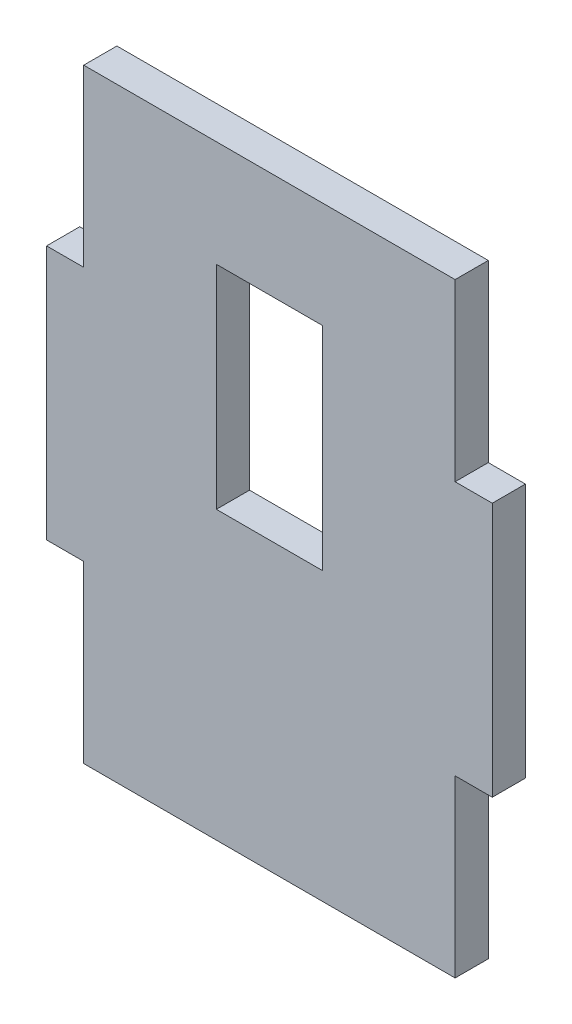
ISO-10303-21;
HEADER;
FILE_DESCRIPTION(('STEP AP214'),'2;1');
FILE_NAME('part.step','',(''),(''),'','','');
FILE_SCHEMA(('AUTOMOTIVE_DESIGN { 1 0 10303 214 1 1 1 1 }'));
ENDSEC;
DATA;
#1=APPLICATION_CONTEXT('core data for automotive mechanical design processes');
#2=APPLICATION_PROTOCOL_DEFINITION('international standard','automotive_design',2000,#1);
#3=PRODUCT_CONTEXT('',#1,'mechanical');
#4=PRODUCT('Part','Part','',(#3));
#5=PRODUCT_RELATED_PRODUCT_CATEGORY('part','',(#4));
#6=PRODUCT_DEFINITION_FORMATION('','',#4);
#7=PRODUCT_DEFINITION_CONTEXT('part definition',#1,'design');
#8=PRODUCT_DEFINITION('design','',#6,#7);
#9=PRODUCT_DEFINITION_SHAPE('','',#8);
#10=(LENGTH_UNIT() NAMED_UNIT(*) SI_UNIT(.MILLI.,.METRE.));
#11=(NAMED_UNIT(*) PLANE_ANGLE_UNIT() SI_UNIT($,.RADIAN.));
#12=(NAMED_UNIT(*) SI_UNIT($,.STERADIAN.) SOLID_ANGLE_UNIT());
#13=UNCERTAINTY_MEASURE_WITH_UNIT(LENGTH_MEASURE(1.E-05),#10,'distance_accuracy_value','');
#14=(GEOMETRIC_REPRESENTATION_CONTEXT(3) GLOBAL_UNCERTAINTY_ASSIGNED_CONTEXT((#13)) GLOBAL_UNIT_ASSIGNED_CONTEXT((#10,
#11,#12)) REPRESENTATION_CONTEXT('',''));
#15=CARTESIAN_POINT('',(0.,0.,0.));
#16=DIRECTION('',(0.,0.,1.));
#17=DIRECTION('',(1.,0.,0.));
#18=AXIS2_PLACEMENT_3D('',#15,#16,#17);
#19=CARTESIAN_POINT('',(-109.779310344828,244.11724137931,25.));
#20=DIRECTION('',(1.,0.,0.));
#21=DIRECTION('',(0.,0.,-1.));
#22=AXIS2_PLACEMENT_3D('',#19,#20,#21);
#23=PLANE('',#22);
#24=DIRECTION('',(0.,0.,-1.));
#25=VECTOR('',#24,1.);
#26=CARTESIAN_POINT('',(-109.779310344828,-79.8827586206897,25.));
#27=LINE('',#26,#25);
#28=CARTESIAN_POINT('',(-109.779310344828,-79.8827586206897,25.));
#29=VERTEX_POINT('',#28);
#30=CARTESIAN_POINT('',(-109.779310344828,-79.8827586206896,0.));
#31=VERTEX_POINT('',#30);
#32=EDGE_CURVE('E259',#29,#31,#27,.T.);
#33=ORIENTED_EDGE('',*,*,#32,.F.);
#34=DIRECTION('',(0.,-1.,0.));
#35=VECTOR('',#34,1.);
#36=CARTESIAN_POINT('',(-109.779310344828,244.11724137931,25.));
#37=LINE('',#36,#35);
#38=CARTESIAN_POINT('',(-109.779310344828,112.11724137931,25.));
#39=VERTEX_POINT('',#38);
#40=EDGE_CURVE('E298',#39,#29,#37,.T.);
#41=ORIENTED_EDGE('',*,*,#40,.F.);
#42=DIRECTION('',(0.,0.,-1.));
#43=VECTOR('',#42,1.);
#44=CARTESIAN_POINT('',(-109.779310344828,112.11724137931,25.));
#45=LINE('',#44,#43);
#46=CARTESIAN_POINT('',(-109.779310344828,112.11724137931,0.));
#47=VERTEX_POINT('',#46);
#48=EDGE_CURVE('E293',#39,#47,#45,.T.);
#49=ORIENTED_EDGE('',*,*,#48,.T.);
#50=DIRECTION('',(0.,-1.,0.));
#51=VECTOR('',#50,1.);
#52=CARTESIAN_POINT('',(-109.779310344828,244.11724137931,0.));
#53=LINE('',#52,#51);
#54=EDGE_CURVE('E297',#47,#31,#53,.T.);
#55=ORIENTED_EDGE('',*,*,#54,.T.);
#56=EDGE_LOOP('',(#33,#41,#49,#55));
#57=FACE_BOUND('',#56,.T.);
#58=ADVANCED_FACE('F38',(#57),#23,.F.);
#59=CARTESIAN_POINT('',(-109.779310344828,-211.88275862069,25.));
#60=DIRECTION('',(0.,1.,0.));
#61=DIRECTION('',(0.,0.,1.));
#62=AXIS2_PLACEMENT_3D('',#59,#60,#61);
#63=PLANE('',#62);
#64=DIRECTION('',(0.,0.,-1.));
#65=VECTOR('',#64,1.);
#66=CARTESIAN_POINT('',(-81.7793103448277,-211.88275862069,25.));
#67=LINE('',#66,#65);
#68=CARTESIAN_POINT('',(-81.7793103448277,-211.88275862069,25.));
#69=VERTEX_POINT('',#68);
#70=CARTESIAN_POINT('',(-81.7793103448277,-211.88275862069,0.));
#71=VERTEX_POINT('',#70);
#72=EDGE_CURVE('E240',#69,#71,#67,.T.);
#73=ORIENTED_EDGE('',*,*,#72,.T.);
#74=DIRECTION('',(1.,0.,0.));
#75=VECTOR('',#74,1.);
#76=CARTESIAN_POINT('',(-109.779310344828,-211.88275862069,0.));
#77=LINE('',#76,#75);
#78=CARTESIAN_POINT('',(198.220689655172,-211.88275862069,0.));
#79=VERTEX_POINT('',#78);
#80=EDGE_CURVE('E312',#71,#79,#77,.T.);
#81=ORIENTED_EDGE('',*,*,#80,.T.);
#82=DIRECTION('',(0.,0.,-1.));
#83=VECTOR('',#82,1.);
#84=CARTESIAN_POINT('',(198.220689655172,-211.88275862069,25.));
#85=LINE('',#84,#83);
#86=CARTESIAN_POINT('',(198.220689655172,-211.88275862069,25.));
#87=VERTEX_POINT('',#86);
#88=EDGE_CURVE('E235',#87,#79,#85,.T.);
#89=ORIENTED_EDGE('',*,*,#88,.F.);
#90=DIRECTION('',(1.,0.,0.));
#91=VECTOR('',#90,1.);
#92=CARTESIAN_POINT('',(-109.779310344828,-211.88275862069,25.));
#93=LINE('',#92,#91);
#94=EDGE_CURVE('E302',#69,#87,#93,.T.);
#95=ORIENTED_EDGE('',*,*,#94,.F.);
#96=EDGE_LOOP('',(#73,#81,#89,#95));
#97=FACE_BOUND('',#96,.T.);
#98=ADVANCED_FACE('F361',(#97),#63,.F.);
#99=CARTESIAN_POINT('',(226.220689655172,244.11724137931,25.));
#100=DIRECTION('',(-1.,0.,0.));
#101=DIRECTION('',(0.,0.,1.));
#102=AXIS2_PLACEMENT_3D('',#99,#100,#101);
#103=PLANE('',#102);
#104=DIRECTION('',(0.,0.,-1.));
#105=VECTOR('',#104,1.);
#106=CARTESIAN_POINT('',(226.220689655172,-79.8827586206898,25.));
#107=LINE('',#106,#105);
#108=CARTESIAN_POINT('',(226.220689655172,-79.8827586206898,25.));
#109=VERTEX_POINT('',#108);
#110=CARTESIAN_POINT('',(226.220689655172,-79.8827586206898,0.));
#111=VERTEX_POINT('',#110);
#112=EDGE_CURVE('E214',#109,#111,#107,.T.);
#113=ORIENTED_EDGE('',*,*,#112,.T.);
#114=DIRECTION('',(0.,1.,0.));
#115=VECTOR('',#114,1.);
#116=CARTESIAN_POINT('',(226.220689655172,244.11724137931,0.));
#117=LINE('',#116,#115);
#118=CARTESIAN_POINT('',(226.220689655172,112.11724137931,0.));
#119=VERTEX_POINT('',#118);
#120=EDGE_CURVE('E315',#111,#119,#117,.T.);
#121=ORIENTED_EDGE('',*,*,#120,.T.);
#122=DIRECTION('',(0.,0.,-1.));
#123=VECTOR('',#122,1.);
#124=CARTESIAN_POINT('',(226.220689655172,112.11724137931,25.));
#125=LINE('',#124,#123);
#126=CARTESIAN_POINT('',(226.220689655172,112.11724137931,25.));
#127=VERTEX_POINT('',#126);
#128=EDGE_CURVE('E209',#127,#119,#125,.T.);
#129=ORIENTED_EDGE('',*,*,#128,.F.);
#130=DIRECTION('',(0.,1.,0.));
#131=VECTOR('',#130,1.);
#132=CARTESIAN_POINT('',(226.220689655172,244.11724137931,25.));
#133=LINE('',#132,#131);
#134=EDGE_CURVE('E47',#109,#127,#133,.T.);
#135=ORIENTED_EDGE('',*,*,#134,.F.);
#136=EDGE_LOOP('',(#113,#121,#129,#135));
#137=FACE_BOUND('',#136,.T.);
#138=ADVANCED_FACE('F354',(#137),#103,.F.);
#139=CARTESIAN_POINT('',(-109.779310344828,244.11724137931,25.));
#140=DIRECTION('',(0.,-1.,0.));
#141=DIRECTION('',(0.,0.,-1.));
#142=AXIS2_PLACEMENT_3D('',#139,#140,#141);
#143=PLANE('',#142);
#144=DIRECTION('',(0.,0.,-1.));
#145=VECTOR('',#144,1.);
#146=CARTESIAN_POINT('',(198.220689655172,244.11724137931,25.));
#147=LINE('',#146,#145);
#148=CARTESIAN_POINT('',(198.220689655172,244.11724137931,25.));
#149=VERTEX_POINT('',#148);
#150=CARTESIAN_POINT('',(198.220689655172,244.11724137931,0.));
#151=VERTEX_POINT('',#150);
#152=EDGE_CURVE('E223',#149,#151,#147,.T.);
#153=ORIENTED_EDGE('',*,*,#152,.T.);
#154=DIRECTION('',(-1.,0.,0.));
#155=VECTOR('',#154,1.);
#156=CARTESIAN_POINT('',(-109.779310344828,244.11724137931,0.));
#157=LINE('',#156,#155);
#158=CARTESIAN_POINT('',(-81.7793103448277,244.11724137931,0.));
#159=VERTEX_POINT('',#158);
#160=EDGE_CURVE('E41',#151,#159,#157,.T.);
#161=ORIENTED_EDGE('',*,*,#160,.T.);
#162=DIRECTION('',(0.,0.,-1.));
#163=VECTOR('',#162,1.);
#164=CARTESIAN_POINT('',(-81.7793103448277,244.11724137931,25.));
#165=LINE('',#164,#163);
#166=CARTESIAN_POINT('',(-81.7793103448277,244.11724137931,25.));
#167=VERTEX_POINT('',#166);
#168=EDGE_CURVE('E281',#167,#159,#165,.T.);
#169=ORIENTED_EDGE('',*,*,#168,.F.);
#170=DIRECTION('',(-1.,0.,0.));
#171=VECTOR('',#170,1.);
#172=CARTESIAN_POINT('',(-109.779310344828,244.11724137931,25.));
#173=LINE('',#172,#171);
#174=EDGE_CURVE('E11',#149,#167,#173,.T.);
#175=ORIENTED_EDGE('',*,*,#174,.F.);
#176=EDGE_LOOP('',(#153,#161,#169,#175));
#177=FACE_BOUND('',#176,.T.);
#178=ADVANCED_FACE('F326',(#177),#143,.F.);
#179=CARTESIAN_POINT('',(0.,0.,25.));
#180=DIRECTION('',(0.,0.,1.));
#181=DIRECTION('',(1.,0.,0.));
#182=AXIS2_PLACEMENT_3D('',#179,#180,#181);
#183=PLANE('',#182);
#184=DIRECTION('',(0.,-1.,0.));
#185=VECTOR('',#184,1.);
#186=CARTESIAN_POINT('',(18.2206896551723,164.11724137931,25.));
#187=LINE('',#186,#185);
#188=CARTESIAN_POINT('',(18.2206896551723,164.11724137931,25.));
#189=VERTEX_POINT('',#188);
#190=CARTESIAN_POINT('',(18.2206896551723,4.11724137931033,25.));
#191=VERTEX_POINT('',#190);
#192=EDGE_CURVE('E55',#189,#191,#187,.T.);
#193=ORIENTED_EDGE('',*,*,#192,.F.);
#194=DIRECTION('',(-1.,0.,0.));
#195=VECTOR('',#194,1.);
#196=CARTESIAN_POINT('',(18.2206896551723,164.11724137931,25.));
#197=LINE('',#196,#195);
#198=CARTESIAN_POINT('',(98.2206896551723,164.11724137931,25.));
#199=VERTEX_POINT('',#198);
#200=EDGE_CURVE('E174',#199,#189,#197,.T.);
#201=ORIENTED_EDGE('',*,*,#200,.F.);
#202=DIRECTION('',(0.,1.,0.));
#203=VECTOR('',#202,1.);
#204=CARTESIAN_POINT('',(98.2206896551723,164.11724137931,25.));
#205=LINE('',#204,#203);
#206=CARTESIAN_POINT('',(98.2206896551723,4.11724137931033,25.));
#207=VERTEX_POINT('',#206);
#208=EDGE_CURVE('E178',#207,#199,#205,.T.);
#209=ORIENTED_EDGE('',*,*,#208,.F.);
#210=DIRECTION('',(1.,0.,0.));
#211=VECTOR('',#210,1.);
#212=CARTESIAN_POINT('',(18.2206896551723,4.11724137931033,25.));
#213=LINE('',#212,#211);
#214=EDGE_CURVE('E187',#191,#207,#213,.T.);
#215=ORIENTED_EDGE('',*,*,#214,.F.);
#216=EDGE_LOOP('',(#193,#201,#209,#215));
#217=FACE_BOUND('',#216,.T.);
#218=DIRECTION('',(-1.,0.,0.));
#219=VECTOR('',#218,1.);
#220=CARTESIAN_POINT('',(-109.779310344828,-79.8827586206897,25.));
#221=LINE('',#220,#219);
#222=CARTESIAN_POINT('',(-81.7793103448277,-79.8827586206897,25.));
#223=VERTEX_POINT('',#222);
#224=EDGE_CURVE('E255',#223,#29,#221,.T.);
#225=ORIENTED_EDGE('',*,*,#224,.F.);
#226=DIRECTION('',(0.,1.,0.));
#227=VECTOR('',#226,1.);
#228=CARTESIAN_POINT('',(-81.7793103448277,-211.88275862069,25.));
#229=LINE('',#228,#227);
#230=EDGE_CURVE('E252',#69,#223,#229,.T.);
#231=ORIENTED_EDGE('',*,*,#230,.F.);
#232=ORIENTED_EDGE('',*,*,#94,.T.);
#233=DIRECTION('',(0.,-1.,0.));
#234=VECTOR('',#233,1.);
#235=CARTESIAN_POINT('',(198.220689655172,-211.88275862069,25.));
#236=LINE('',#235,#234);
#237=CARTESIAN_POINT('',(198.220689655172,-79.8827586206898,25.));
#238=VERTEX_POINT('',#237);
#239=EDGE_CURVE('E231',#238,#87,#236,.T.);
#240=ORIENTED_EDGE('',*,*,#239,.F.);
#241=DIRECTION('',(-1.,0.,0.));
#242=VECTOR('',#241,1.);
#243=CARTESIAN_POINT('',(226.220689655172,-79.8827586206898,25.));
#244=LINE('',#243,#242);
#245=EDGE_CURVE('E228',#109,#238,#244,.T.);
#246=ORIENTED_EDGE('',*,*,#245,.F.);
#247=ORIENTED_EDGE('',*,*,#134,.T.);
#248=DIRECTION('',(1.,0.,0.));
#249=VECTOR('',#248,1.);
#250=CARTESIAN_POINT('',(226.220689655172,112.11724137931,25.));
#251=LINE('',#250,#249);
#252=CARTESIAN_POINT('',(198.220689655172,112.11724137931,25.));
#253=VERTEX_POINT('',#252);
#254=EDGE_CURVE('E205',#253,#127,#251,.T.);
#255=ORIENTED_EDGE('',*,*,#254,.F.);
#256=DIRECTION('',(0.,-1.,0.));
#257=VECTOR('',#256,1.);
#258=CARTESIAN_POINT('',(198.220689655172,244.11724137931,25.));
#259=LINE('',#258,#257);
#260=EDGE_CURVE('E202',#149,#253,#259,.T.);
#261=ORIENTED_EDGE('',*,*,#260,.F.);
#262=ORIENTED_EDGE('',*,*,#174,.T.);
#263=DIRECTION('',(0.,1.,0.));
#264=VECTOR('',#263,1.);
#265=CARTESIAN_POINT('',(-81.7793103448277,244.11724137931,25.));
#266=LINE('',#265,#264);
#267=CARTESIAN_POINT('',(-81.7793103448277,112.11724137931,25.));
#268=VERTEX_POINT('',#267);
#269=EDGE_CURVE('E277',#268,#167,#266,.T.);
#270=ORIENTED_EDGE('',*,*,#269,.F.);
#271=DIRECTION('',(1.,0.,0.));
#272=VECTOR('',#271,1.);
#273=CARTESIAN_POINT('',(-109.779310344828,112.11724137931,25.));
#274=LINE('',#273,#272);
#275=EDGE_CURVE('E274',#39,#268,#274,.T.);
#276=ORIENTED_EDGE('',*,*,#275,.F.);
#277=ORIENTED_EDGE('',*,*,#40,.T.);
#278=EDGE_LOOP('',(#225,#231,#232,#240,#246,#247,#255,#261,#262,#270,#276,#277));
#279=FACE_BOUND('',#278,.T.);
#280=ADVANCED_FACE('F337',(#217,#279),#183,.T.);
#281=CARTESIAN_POINT('',(0.,0.,0.));
#282=DIRECTION('',(0.,0.,1.));
#283=DIRECTION('',(1.,0.,0.));
#284=AXIS2_PLACEMENT_3D('',#281,#282,#283);
#285=PLANE('',#284);
#286=DIRECTION('',(-1.,0.,0.));
#287=VECTOR('',#286,1.);
#288=CARTESIAN_POINT('',(18.2206896551723,164.11724137931,0.));
#289=LINE('',#288,#287);
#290=CARTESIAN_POINT('',(98.2206896551723,164.11724137931,0.));
#291=VERTEX_POINT('',#290);
#292=CARTESIAN_POINT('',(18.2206896551723,164.11724137931,0.));
#293=VERTEX_POINT('',#292);
#294=EDGE_CURVE('E162',#291,#293,#289,.T.);
#295=ORIENTED_EDGE('',*,*,#294,.T.);
#296=DIRECTION('',(0.,-1.,0.));
#297=VECTOR('',#296,1.);
#298=CARTESIAN_POINT('',(18.2206896551723,164.11724137931,0.));
#299=LINE('',#298,#297);
#300=CARTESIAN_POINT('',(18.2206896551723,4.11724137931033,0.));
#301=VERTEX_POINT('',#300);
#302=EDGE_CURVE('E155',#293,#301,#299,.T.);
#303=ORIENTED_EDGE('',*,*,#302,.T.);
#304=DIRECTION('',(1.,0.,0.));
#305=VECTOR('',#304,1.);
#306=CARTESIAN_POINT('',(18.2206896551723,4.11724137931033,0.));
#307=LINE('',#306,#305);
#308=CARTESIAN_POINT('',(98.2206896551723,4.11724137931033,0.));
#309=VERTEX_POINT('',#308);
#310=EDGE_CURVE('E165',#301,#309,#307,.T.);
#311=ORIENTED_EDGE('',*,*,#310,.T.);
#312=DIRECTION('',(0.,1.,0.));
#313=VECTOR('',#312,1.);
#314=CARTESIAN_POINT('',(98.2206896551723,164.11724137931,0.));
#315=LINE('',#314,#313);
#316=EDGE_CURVE('E63',#309,#291,#315,.T.);
#317=ORIENTED_EDGE('',*,*,#316,.T.);
#318=EDGE_LOOP('',(#295,#303,#311,#317));
#319=FACE_BOUND('',#318,.T.);
#320=DIRECTION('',(0.,1.,0.));
#321=VECTOR('',#320,1.);
#322=CARTESIAN_POINT('',(-81.7793103448277,-211.88275862069,0.));
#323=LINE('',#322,#321);
#324=CARTESIAN_POINT('',(-81.7793103448277,-79.8827586206897,0.));
#325=VERTEX_POINT('',#324);
#326=EDGE_CURVE('E196',#71,#325,#323,.T.);
#327=ORIENTED_EDGE('',*,*,#326,.T.);
#328=DIRECTION('',(-1.,0.,0.));
#329=VECTOR('',#328,1.);
#330=CARTESIAN_POINT('',(-109.779310344828,-79.8827586206897,0.));
#331=LINE('',#330,#329);
#332=EDGE_CURVE('E256',#325,#31,#331,.T.);
#333=ORIENTED_EDGE('',*,*,#332,.T.);
#334=ORIENTED_EDGE('',*,*,#54,.F.);
#335=DIRECTION('',(1.,0.,0.));
#336=VECTOR('',#335,1.);
#337=CARTESIAN_POINT('',(-109.779310344828,112.11724137931,0.));
#338=LINE('',#337,#336);
#339=CARTESIAN_POINT('',(-81.7793103448277,112.11724137931,0.));
#340=VERTEX_POINT('',#339);
#341=EDGE_CURVE('E227',#47,#340,#338,.T.);
#342=ORIENTED_EDGE('',*,*,#341,.T.);
#343=DIRECTION('',(0.,1.,0.));
#344=VECTOR('',#343,1.);
#345=CARTESIAN_POINT('',(-81.7793103448277,244.11724137931,0.));
#346=LINE('',#345,#344);
#347=EDGE_CURVE('E278',#340,#159,#346,.T.);
#348=ORIENTED_EDGE('',*,*,#347,.T.);
#349=ORIENTED_EDGE('',*,*,#160,.F.);
#350=DIRECTION('',(0.,-1.,0.));
#351=VECTOR('',#350,1.);
#352=CARTESIAN_POINT('',(198.220689655172,244.11724137931,0.));
#353=LINE('',#352,#351);
#354=CARTESIAN_POINT('',(198.220689655172,112.11724137931,0.));
#355=VERTEX_POINT('',#354);
#356=EDGE_CURVE('E210',#151,#355,#353,.T.);
#357=ORIENTED_EDGE('',*,*,#356,.T.);
#358=DIRECTION('',(1.,0.,0.));
#359=VECTOR('',#358,1.);
#360=CARTESIAN_POINT('',(226.220689655172,112.11724137931,0.));
#361=LINE('',#360,#359);
#362=EDGE_CURVE('E206',#355,#119,#361,.T.);
#363=ORIENTED_EDGE('',*,*,#362,.T.);
#364=ORIENTED_EDGE('',*,*,#120,.F.);
#365=DIRECTION('',(-1.,0.,0.));
#366=VECTOR('',#365,1.);
#367=CARTESIAN_POINT('',(226.220689655172,-79.8827586206898,0.));
#368=LINE('',#367,#366);
#369=CARTESIAN_POINT('',(198.220689655172,-79.8827586206898,0.));
#370=VERTEX_POINT('',#369);
#371=EDGE_CURVE('E236',#111,#370,#368,.T.);
#372=ORIENTED_EDGE('',*,*,#371,.T.);
#373=DIRECTION('',(0.,-1.,0.));
#374=VECTOR('',#373,1.);
#375=CARTESIAN_POINT('',(198.220689655172,-211.88275862069,0.));
#376=LINE('',#375,#374);
#377=EDGE_CURVE('E232',#370,#79,#376,.T.);
#378=ORIENTED_EDGE('',*,*,#377,.T.);
#379=ORIENTED_EDGE('',*,*,#80,.F.);
#380=EDGE_LOOP('',(#327,#333,#334,#342,#348,#349,#357,#363,#364,#372,#378,#379));
#381=FACE_BOUND('',#380,.T.);
#382=ADVANCED_FACE('F170',(#319,#381),#285,.F.);
#383=CARTESIAN_POINT('',(-109.779310344828,112.11724137931,25.));
#384=DIRECTION('',(0.,1.,0.));
#385=DIRECTION('',(-1.,0.,0.));
#386=AXIS2_PLACEMENT_3D('',#383,#384,#385);
#387=PLANE('',#386);
#388=ORIENTED_EDGE('',*,*,#341,.F.);
#389=ORIENTED_EDGE('',*,*,#48,.F.);
#390=ORIENTED_EDGE('',*,*,#275,.T.);
#391=DIRECTION('',(0.,0.,-1.));
#392=VECTOR('',#391,1.);
#393=CARTESIAN_POINT('',(-81.7793103448277,112.11724137931,25.));
#394=LINE('',#393,#392);
#395=EDGE_CURVE('E290',#268,#340,#394,.T.);
#396=ORIENTED_EDGE('',*,*,#395,.T.);
#397=EDGE_LOOP('',(#388,#389,#390,#396));
#398=FACE_BOUND('',#397,.T.);
#399=ADVANCED_FACE('F372',(#398),#387,.T.);
#400=CARTESIAN_POINT('',(-81.7793103448277,244.11724137931,25.));
#401=DIRECTION('',(-1.,0.,0.));
#402=DIRECTION('',(0.,0.,1.));
#403=AXIS2_PLACEMENT_3D('',#400,#401,#402);
#404=PLANE('',#403);
#405=ORIENTED_EDGE('',*,*,#347,.F.);
#406=ORIENTED_EDGE('',*,*,#395,.F.);
#407=ORIENTED_EDGE('',*,*,#269,.T.);
#408=ORIENTED_EDGE('',*,*,#168,.T.);
#409=EDGE_LOOP('',(#405,#406,#407,#408));
#410=FACE_BOUND('',#409,.T.);
#411=ADVANCED_FACE('F332',(#410),#404,.T.);
#412=CARTESIAN_POINT('',(198.220689655172,244.11724137931,25.));
#413=DIRECTION('',(1.,0.,0.));
#414=DIRECTION('',(0.,1.,0.));
#415=AXIS2_PLACEMENT_3D('',#412,#413,#414);
#416=PLANE('',#415);
#417=ORIENTED_EDGE('',*,*,#356,.F.);
#418=ORIENTED_EDGE('',*,*,#152,.F.);
#419=ORIENTED_EDGE('',*,*,#260,.T.);
#420=DIRECTION('',(0.,0.,-1.));
#421=VECTOR('',#420,1.);
#422=CARTESIAN_POINT('',(198.220689655172,112.11724137931,25.));
#423=LINE('',#422,#421);
#424=EDGE_CURVE('E220',#253,#355,#423,.T.);
#425=ORIENTED_EDGE('',*,*,#424,.T.);
#426=EDGE_LOOP('',(#417,#418,#419,#425));
#427=FACE_BOUND('',#426,.T.);
#428=ADVANCED_FACE('F343',(#427),#416,.T.);
#429=CARTESIAN_POINT('',(226.220689655172,112.11724137931,25.));
#430=DIRECTION('',(0.,1.,0.));
#431=DIRECTION('',(0.,0.,1.));
#432=AXIS2_PLACEMENT_3D('',#429,#430,#431);
#433=PLANE('',#432);
#434=ORIENTED_EDGE('',*,*,#362,.F.);
#435=ORIENTED_EDGE('',*,*,#424,.F.);
#436=ORIENTED_EDGE('',*,*,#254,.T.);
#437=ORIENTED_EDGE('',*,*,#128,.T.);
#438=EDGE_LOOP('',(#434,#435,#436,#437));
#439=FACE_BOUND('',#438,.T.);
#440=ADVANCED_FACE('F346',(#439),#433,.T.);
#441=CARTESIAN_POINT('',(226.220689655172,-79.8827586206898,25.));
#442=DIRECTION('',(0.,-1.,0.));
#443=DIRECTION('',(0.,0.,-1.));
#444=AXIS2_PLACEMENT_3D('',#441,#442,#443);
#445=PLANE('',#444);
#446=ORIENTED_EDGE('',*,*,#371,.F.);
#447=ORIENTED_EDGE('',*,*,#112,.F.);
#448=ORIENTED_EDGE('',*,*,#245,.T.);
#449=DIRECTION('',(0.,0.,-1.));
#450=VECTOR('',#449,1.);
#451=CARTESIAN_POINT('',(198.220689655172,-79.8827586206898,25.));
#452=LINE('',#451,#450);
#453=EDGE_CURVE('E246',#238,#370,#452,.T.);
#454=ORIENTED_EDGE('',*,*,#453,.T.);
#455=EDGE_LOOP('',(#446,#447,#448,#454));
#456=FACE_BOUND('',#455,.T.);
#457=ADVANCED_FACE('F350',(#456),#445,.T.);
#458=CARTESIAN_POINT('',(198.220689655172,-211.88275862069,25.));
#459=DIRECTION('',(1.,0.,0.));
#460=DIRECTION('',(0.,1.,0.));
#461=AXIS2_PLACEMENT_3D('',#458,#459,#460);
#462=PLANE('',#461);
#463=ORIENTED_EDGE('',*,*,#377,.F.);
#464=ORIENTED_EDGE('',*,*,#453,.F.);
#465=ORIENTED_EDGE('',*,*,#239,.T.);
#466=ORIENTED_EDGE('',*,*,#88,.T.);
#467=EDGE_LOOP('',(#463,#464,#465,#466));
#468=FACE_BOUND('',#467,.T.);
#469=ADVANCED_FACE('F357',(#468),#462,.T.);
#470=CARTESIAN_POINT('',(-81.7793103448277,-211.88275862069,25.));
#471=DIRECTION('',(-1.,0.,0.));
#472=DIRECTION('',(0.,0.,1.));
#473=AXIS2_PLACEMENT_3D('',#470,#471,#472);
#474=PLANE('',#473);
#475=ORIENTED_EDGE('',*,*,#326,.F.);
#476=ORIENTED_EDGE('',*,*,#72,.F.);
#477=ORIENTED_EDGE('',*,*,#230,.T.);
#478=DIRECTION('',(0.,0.,-1.));
#479=VECTOR('',#478,1.);
#480=CARTESIAN_POINT('',(-81.7793103448277,-79.8827586206897,25.));
#481=LINE('',#480,#479);
#482=EDGE_CURVE('E268',#223,#325,#481,.T.);
#483=ORIENTED_EDGE('',*,*,#482,.T.);
#484=EDGE_LOOP('',(#475,#476,#477,#483));
#485=FACE_BOUND('',#484,.T.);
#486=ADVANCED_FACE('F365',(#485),#474,.T.);
#487=CARTESIAN_POINT('',(-109.779310344828,-79.8827586206897,25.));
#488=DIRECTION('',(0.,-1.,0.));
#489=DIRECTION('',(1.,0.,0.));
#490=AXIS2_PLACEMENT_3D('',#487,#488,#489);
#491=PLANE('',#490);
#492=ORIENTED_EDGE('',*,*,#332,.F.);
#493=ORIENTED_EDGE('',*,*,#482,.F.);
#494=ORIENTED_EDGE('',*,*,#224,.T.);
#495=ORIENTED_EDGE('',*,*,#32,.T.);
#496=EDGE_LOOP('',(#492,#493,#494,#495));
#497=FACE_BOUND('',#496,.T.);
#498=ADVANCED_FACE('F368',(#497),#491,.T.);
#499=CARTESIAN_POINT('',(18.2206896551723,164.11724137931,0.));
#500=DIRECTION('',(-1.,0.,0.));
#501=DIRECTION('',(0.,-1.,0.));
#502=AXIS2_PLACEMENT_3D('',#499,#500,#501);
#503=PLANE('',#502);
#504=ORIENTED_EDGE('',*,*,#192,.T.);
#505=DIRECTION('',(0.,0.,1.));
#506=VECTOR('',#505,1.);
#507=CARTESIAN_POINT('',(18.2206896551723,4.11724137931033,0.));
#508=LINE('',#507,#506);
#509=EDGE_CURVE('E151',#301,#191,#508,.T.);
#510=ORIENTED_EDGE('',*,*,#509,.F.);
#511=ORIENTED_EDGE('',*,*,#302,.F.);
#512=DIRECTION('',(0.,0.,1.));
#513=VECTOR('',#512,1.);
#514=CARTESIAN_POINT('',(18.2206896551723,164.11724137931,0.));
#515=LINE('',#514,#513);
#516=EDGE_CURVE('E193',#293,#189,#515,.T.);
#517=ORIENTED_EDGE('',*,*,#516,.T.);
#518=EDGE_LOOP('',(#504,#510,#511,#517));
#519=FACE_BOUND('',#518,.T.);
#520=ADVANCED_FACE('F153',(#519),#503,.F.);
#521=CARTESIAN_POINT('',(18.2206896551723,164.11724137931,0.));
#522=DIRECTION('',(0.,1.,0.));
#523=DIRECTION('',(0.,0.,1.));
#524=AXIS2_PLACEMENT_3D('',#521,#522,#523);
#525=PLANE('',#524);
#526=ORIENTED_EDGE('',*,*,#200,.T.);
#527=ORIENTED_EDGE('',*,*,#516,.F.);
#528=ORIENTED_EDGE('',*,*,#294,.F.);
#529=DIRECTION('',(0.,0.,1.));
#530=VECTOR('',#529,1.);
#531=CARTESIAN_POINT('',(98.2206896551723,164.11724137931,0.));
#532=LINE('',#531,#530);
#533=EDGE_CURVE('E197',#291,#199,#532,.T.);
#534=ORIENTED_EDGE('',*,*,#533,.T.);
#535=EDGE_LOOP('',(#526,#527,#528,#534));
#536=FACE_BOUND('',#535,.T.);
#537=ADVANCED_FACE('F402',(#536),#525,.F.);
#538=CARTESIAN_POINT('',(98.2206896551723,164.11724137931,0.));
#539=DIRECTION('',(1.,0.,0.));
#540=DIRECTION('',(0.,0.,-1.));
#541=AXIS2_PLACEMENT_3D('',#538,#539,#540);
#542=PLANE('',#541);
#543=ORIENTED_EDGE('',*,*,#208,.T.);
#544=ORIENTED_EDGE('',*,*,#533,.F.);
#545=ORIENTED_EDGE('',*,*,#316,.F.);
#546=DIRECTION('',(0.,0.,1.));
#547=VECTOR('',#546,1.);
#548=CARTESIAN_POINT('',(98.2206896551723,4.11724137931033,0.));
#549=LINE('',#548,#547);
#550=EDGE_CURVE('E161',#309,#207,#549,.T.);
#551=ORIENTED_EDGE('',*,*,#550,.T.);
#552=EDGE_LOOP('',(#543,#544,#545,#551));
#553=FACE_BOUND('',#552,.T.);
#554=ADVANCED_FACE('F400',(#553),#542,.F.);
#555=CARTESIAN_POINT('',(18.2206896551723,4.11724137931033,0.));
#556=DIRECTION('',(0.,-1.,0.));
#557=DIRECTION('',(0.,0.,-1.));
#558=AXIS2_PLACEMENT_3D('',#555,#556,#557);
#559=PLANE('',#558);
#560=ORIENTED_EDGE('',*,*,#214,.T.);
#561=ORIENTED_EDGE('',*,*,#550,.F.);
#562=ORIENTED_EDGE('',*,*,#310,.F.);
#563=ORIENTED_EDGE('',*,*,#509,.T.);
#564=EDGE_LOOP('',(#560,#561,#562,#563));
#565=FACE_BOUND('',#564,.T.);
#566=ADVANCED_FACE('F166',(#565),#559,.F.);
#567=CLOSED_SHELL('',(#58,#98,#138,#178,#280,#382,#399,#411,#428,#440,#457,#469,#486,#498,#520,
#537,#554,#566));
#568=MANIFOLD_SOLID_BREP('B2',#567);
#569=ADVANCED_BREP_SHAPE_REPRESENTATION('',(#18,#568),#14);
#570=SHAPE_DEFINITION_REPRESENTATION(#9,#569);
ENDSEC;
END-ISO-10303-21;
